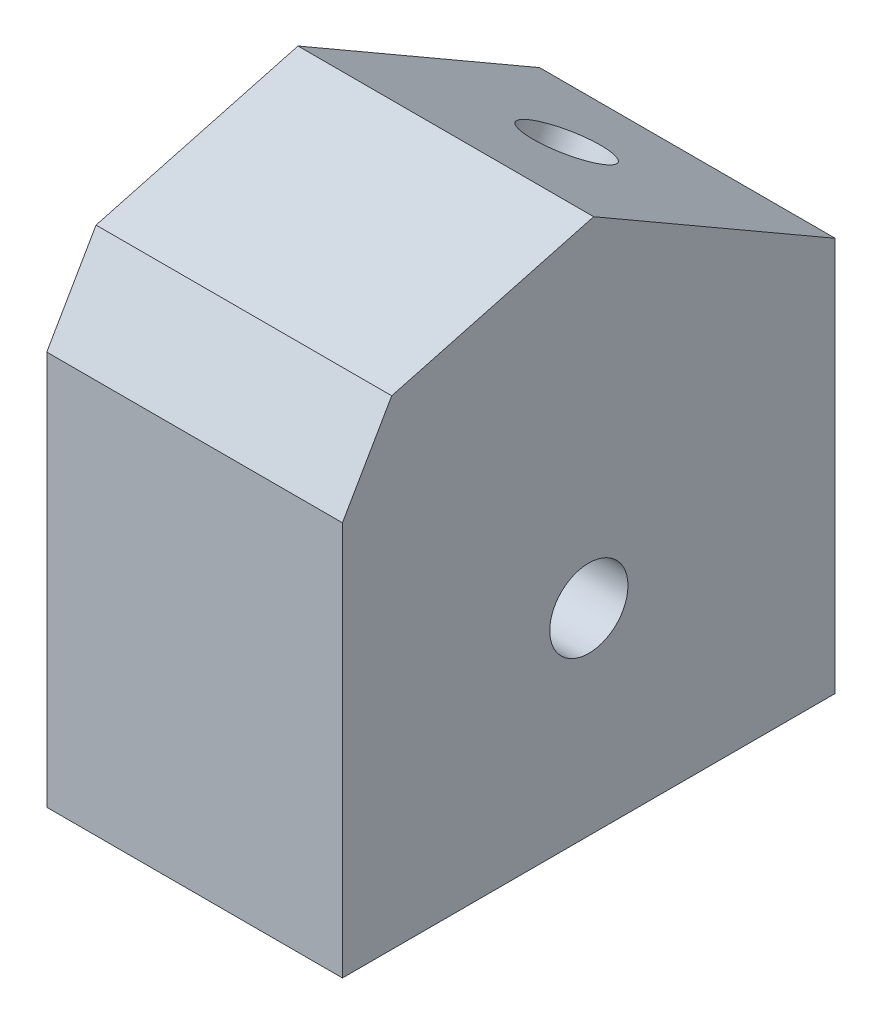
ISO-10303-21;
HEADER;
FILE_DESCRIPTION(('STEP AP214'),'2;1');
FILE_NAME('part.step','',(''),(''),'','','');
FILE_SCHEMA(('AUTOMOTIVE_DESIGN { 1 0 10303 214 1 1 1 1 }'));
ENDSEC;
DATA;
#1=APPLICATION_CONTEXT('core data for automotive mechanical design processes');
#2=APPLICATION_PROTOCOL_DEFINITION('international standard','automotive_design',2000,#1);
#3=PRODUCT_CONTEXT('',#1,'mechanical');
#4=PRODUCT('Part','Part','',(#3));
#5=PRODUCT_RELATED_PRODUCT_CATEGORY('part','',(#4));
#6=PRODUCT_DEFINITION_FORMATION('','',#4);
#7=PRODUCT_DEFINITION_CONTEXT('part definition',#1,'design');
#8=PRODUCT_DEFINITION('design','',#6,#7);
#9=PRODUCT_DEFINITION_SHAPE('','',#8);
#10=(LENGTH_UNIT() NAMED_UNIT(*) SI_UNIT(.MILLI.,.METRE.));
#11=(NAMED_UNIT(*) PLANE_ANGLE_UNIT() SI_UNIT($,.RADIAN.));
#12=(NAMED_UNIT(*) SI_UNIT($,.STERADIAN.) SOLID_ANGLE_UNIT());
#13=UNCERTAINTY_MEASURE_WITH_UNIT(LENGTH_MEASURE(1.E-05),#10,'distance_accuracy_value','');
#14=(GEOMETRIC_REPRESENTATION_CONTEXT(3) GLOBAL_UNCERTAINTY_ASSIGNED_CONTEXT((#13)) GLOBAL_UNIT_ASSIGNED_CONTEXT((#10,
#11,#12)) REPRESENTATION_CONTEXT('',''));
#15=CARTESIAN_POINT('',(0.,0.,0.));
#16=DIRECTION('',(0.,0.,1.));
#17=DIRECTION('',(1.,0.,0.));
#18=AXIS2_PLACEMENT_3D('',#15,#16,#17);
#19=CARTESIAN_POINT('',(15.,0.,0.));
#20=DIRECTION('',(-1.,0.,0.));
#21=DIRECTION('',(0.,0.,1.));
#22=AXIS2_PLACEMENT_3D('',#19,#20,#21);
#23=PLANE('',#22);
#24=DIRECTION('',(0.,0.499999999999994,0.866025403784442));
#25=VECTOR('',#24,1.);
#26=CARTESIAN_POINT('',(15.,41.6506350946108,12.5000000000003));
#27=LINE('',#26,#25);
#28=CARTESIAN_POINT('',(15.,20.,-25.));
#29=VERTEX_POINT('',#28);
#30=CARTESIAN_POINT('',(15.,34.1506350946109,-0.490381056766371));
#31=VERTEX_POINT('',#30);
#32=EDGE_CURVE('E123',#29,#31,#27,.T.);
#33=ORIENTED_EDGE('',*,*,#32,.T.);
#34=DIRECTION('',(0.,0.258819045102526,-0.965925826289067));
#35=VECTOR('',#34,1.);
#36=CARTESIAN_POINT('',(15.,28.6602540378442,20.0000000000002));
#37=LINE('',#36,#35);
#38=CARTESIAN_POINT('',(15.,28.6602540378442,20.0000000000002));
#39=VERTEX_POINT('',#38);
#40=EDGE_CURVE('E11',#31,#39,#37,.F.);
#41=ORIENTED_EDGE('',*,*,#40,.T.);
#42=DIRECTION('',(0.,-0.866025403784442,0.499999999999994));
#43=VECTOR('',#42,1.);
#44=CARTESIAN_POINT('',(15.,20.,25.));
#45=LINE('',#44,#43);
#46=CARTESIAN_POINT('',(15.,20.,25.));
#47=VERTEX_POINT('',#46);
#48=EDGE_CURVE('E126',#39,#47,#45,.T.);
#49=ORIENTED_EDGE('',*,*,#48,.T.);
#50=DIRECTION('',(0.,-1.,0.));
#51=VECTOR('',#50,1.);
#52=CARTESIAN_POINT('',(15.,-20.,25.));
#53=LINE('',#52,#51);
#54=CARTESIAN_POINT('',(15.,-20.,25.));
#55=VERTEX_POINT('',#54);
#56=EDGE_CURVE('E141',#47,#55,#53,.T.);
#57=ORIENTED_EDGE('',*,*,#56,.T.);
#58=DIRECTION('',(0.,0.,-1.));
#59=VECTOR('',#58,1.);
#60=CARTESIAN_POINT('',(15.,-20.,-25.));
#61=LINE('',#60,#59);
#62=CARTESIAN_POINT('',(15.,-20.,-25.));
#63=VERTEX_POINT('',#62);
#64=EDGE_CURVE('E139',#55,#63,#61,.T.);
#65=ORIENTED_EDGE('',*,*,#64,.T.);
#66=DIRECTION('',(0.,1.,0.));
#67=VECTOR('',#66,1.);
#68=CARTESIAN_POINT('',(15.,-20.,-25.));
#69=LINE('',#68,#67);
#70=EDGE_CURVE('E137',#63,#29,#69,.T.);
#71=ORIENTED_EDGE('',*,*,#70,.T.);
#72=EDGE_LOOP('',(#33,#41,#49,#57,#65,#71));
#73=FACE_BOUND('',#72,.T.);
#74=CARTESIAN_POINT('',(15.,0.,0.));
#75=DIRECTION('',(1.,0.,0.));
#76=DIRECTION('',(0.,0.,-1.));
#77=AXIS2_PLACEMENT_3D('',#74,#75,#76);
#78=CIRCLE('',#77,3.97);
#79=CARTESIAN_POINT('',(15.,0.,-3.96999999999999));
#80=VERTEX_POINT('',#79);
#81=EDGE_CURVE('E135',#80,#80,#78,.T.);
#82=ORIENTED_EDGE('',*,*,#81,.F.);
#83=EDGE_LOOP('',(#82));
#84=FACE_BOUND('',#83,.T.);
#85=ADVANCED_FACE('F38',(#73,#84),#23,.F.);
#86=CARTESIAN_POINT('',(-15.,0.,0.));
#87=DIRECTION('',(-1.,0.,0.));
#88=DIRECTION('',(0.,0.,1.));
#89=AXIS2_PLACEMENT_3D('',#86,#87,#88);
#90=PLANE('',#89);
#91=DIRECTION('',(0.,-0.866025403784442,0.499999999999994));
#92=VECTOR('',#91,1.);
#93=CARTESIAN_POINT('',(-15.,20.,25.));
#94=LINE('',#93,#92);
#95=CARTESIAN_POINT('',(-15.,28.6602540378442,20.0000000000002));
#96=VERTEX_POINT('',#95);
#97=CARTESIAN_POINT('',(-15.,20.,25.));
#98=VERTEX_POINT('',#97);
#99=EDGE_CURVE('E133',#96,#98,#94,.T.);
#100=ORIENTED_EDGE('',*,*,#99,.F.);
#101=DIRECTION('',(0.,-0.258819045102526,0.965925826289067));
#102=VECTOR('',#101,1.);
#103=CARTESIAN_POINT('',(-15.,31.7403810567664,8.50480947161685));
#104=LINE('',#103,#102);
#105=CARTESIAN_POINT('',(-15.,34.1506350946109,-0.490381056766371));
#106=VERTEX_POINT('',#105);
#107=EDGE_CURVE('E60',#96,#106,#104,.F.);
#108=ORIENTED_EDGE('',*,*,#107,.T.);
#109=DIRECTION('',(0.,0.499999999999994,0.866025403784442));
#110=VECTOR('',#109,1.);
#111=CARTESIAN_POINT('',(-15.,41.6506350946108,12.5000000000003));
#112=LINE('',#111,#110);
#113=CARTESIAN_POINT('',(-15.,20.,-25.));
#114=VERTEX_POINT('',#113);
#115=EDGE_CURVE('E124',#114,#106,#112,.T.);
#116=ORIENTED_EDGE('',*,*,#115,.F.);
#117=DIRECTION('',(0.,1.,0.));
#118=VECTOR('',#117,1.);
#119=CARTESIAN_POINT('',(-15.,-20.,-25.));
#120=LINE('',#119,#118);
#121=CARTESIAN_POINT('',(-15.,-20.,-25.));
#122=VERTEX_POINT('',#121);
#123=EDGE_CURVE('E127',#122,#114,#120,.T.);
#124=ORIENTED_EDGE('',*,*,#123,.F.);
#125=DIRECTION('',(0.,0.,-1.));
#126=VECTOR('',#125,1.);
#127=CARTESIAN_POINT('',(-15.,-20.,-25.));
#128=LINE('',#127,#126);
#129=CARTESIAN_POINT('',(-15.,-20.,25.));
#130=VERTEX_POINT('',#129);
#131=EDGE_CURVE('E129',#130,#122,#128,.T.);
#132=ORIENTED_EDGE('',*,*,#131,.F.);
#133=DIRECTION('',(0.,-1.,0.));
#134=VECTOR('',#133,1.);
#135=CARTESIAN_POINT('',(-15.,-20.,25.));
#136=LINE('',#135,#134);
#137=EDGE_CURVE('E131',#98,#130,#136,.T.);
#138=ORIENTED_EDGE('',*,*,#137,.F.);
#139=EDGE_LOOP('',(#100,#108,#116,#124,#132,#138));
#140=FACE_BOUND('',#139,.T.);
#141=CARTESIAN_POINT('',(-15.,0.,0.));
#142=DIRECTION('',(1.,0.,0.));
#143=DIRECTION('',(0.,0.,-1.));
#144=AXIS2_PLACEMENT_3D('',#141,#142,#143);
#145=CIRCLE('',#144,3.97);
#146=CARTESIAN_POINT('',(-15.,0.,-3.96999999999999));
#147=VERTEX_POINT('',#146);
#148=EDGE_CURVE('E144',#147,#147,#145,.T.);
#149=ORIENTED_EDGE('',*,*,#148,.T.);
#150=EDGE_LOOP('',(#149));
#151=FACE_BOUND('',#150,.T.);
#152=ADVANCED_FACE('F194',(#140,#151),#90,.T.);
#153=CARTESIAN_POINT('',(15.,20.,25.));
#154=DIRECTION('',(0.,-0.499999999999994,-0.866025403784442));
#155=DIRECTION('',(0.,0.866025403784442,-0.499999999999994));
#156=AXIS2_PLACEMENT_3D('',#153,#154,#155);
#157=PLANE('',#156);
#158=ORIENTED_EDGE('',*,*,#48,.F.);
#159=DIRECTION('',(-1.,0.,0.));
#160=VECTOR('',#159,1.);
#161=CARTESIAN_POINT('',(15.,28.6602540378442,20.0000000000002));
#162=LINE('',#161,#160);
#163=EDGE_CURVE('E106',#39,#96,#162,.T.);
#164=ORIENTED_EDGE('',*,*,#163,.T.);
#165=ORIENTED_EDGE('',*,*,#99,.T.);
#166=DIRECTION('',(-1.,0.,0.));
#167=VECTOR('',#166,1.);
#168=CARTESIAN_POINT('',(15.,20.,25.));
#169=LINE('',#168,#167);
#170=EDGE_CURVE('E102',#47,#98,#169,.T.);
#171=ORIENTED_EDGE('',*,*,#170,.F.);
#172=EDGE_LOOP('',(#158,#164,#165,#171));
#173=FACE_BOUND('',#172,.T.);
#174=ADVANCED_FACE('F182',(#173),#157,.F.);
#175=CARTESIAN_POINT('',(15.,-20.,25.));
#176=DIRECTION('',(0.,0.,-1.));
#177=DIRECTION('',(-1.,0.,0.));
#178=AXIS2_PLACEMENT_3D('',#175,#176,#177);
#179=PLANE('',#178);
#180=ORIENTED_EDGE('',*,*,#137,.T.);
#181=DIRECTION('',(-1.,0.,0.));
#182=VECTOR('',#181,1.);
#183=CARTESIAN_POINT('',(15.,-20.,25.));
#184=LINE('',#183,#182);
#185=EDGE_CURVE('E114',#55,#130,#184,.T.);
#186=ORIENTED_EDGE('',*,*,#185,.F.);
#187=ORIENTED_EDGE('',*,*,#56,.F.);
#188=ORIENTED_EDGE('',*,*,#170,.T.);
#189=EDGE_LOOP('',(#180,#186,#187,#188));
#190=FACE_BOUND('',#189,.T.);
#191=ADVANCED_FACE('F185',(#190),#179,.F.);
#192=CARTESIAN_POINT('',(15.,-20.,-25.));
#193=DIRECTION('',(0.,1.,0.));
#194=DIRECTION('',(0.,0.,1.));
#195=AXIS2_PLACEMENT_3D('',#192,#193,#194);
#196=PLANE('',#195);
#197=ORIENTED_EDGE('',*,*,#131,.T.);
#198=DIRECTION('',(-1.,0.,0.));
#199=VECTOR('',#198,1.);
#200=CARTESIAN_POINT('',(15.,-20.,-25.));
#201=LINE('',#200,#199);
#202=EDGE_CURVE('E117',#63,#122,#201,.T.);
#203=ORIENTED_EDGE('',*,*,#202,.F.);
#204=ORIENTED_EDGE('',*,*,#64,.F.);
#205=ORIENTED_EDGE('',*,*,#185,.T.);
#206=EDGE_LOOP('',(#197,#203,#204,#205));
#207=FACE_BOUND('',#206,.T.);
#208=ADVANCED_FACE('F191',(#207),#196,.F.);
#209=CARTESIAN_POINT('',(15.,-20.,-25.));
#210=DIRECTION('',(0.,0.,1.));
#211=DIRECTION('',(1.,0.,0.));
#212=AXIS2_PLACEMENT_3D('',#209,#210,#211);
#213=PLANE('',#212);
#214=CARTESIAN_POINT('',(0.,0.,-25.));
#215=DIRECTION('',(0.,0.,-1.));
#216=DIRECTION('',(-1.,0.,0.));
#217=AXIS2_PLACEMENT_3D('',#214,#215,#216);
#218=CIRCLE('',#217,3.97);
#219=CARTESIAN_POINT('',(-3.97,0.,-25.));
#220=VERTEX_POINT('',#219);
#221=EDGE_CURVE('E147',#220,#220,#218,.T.);
#222=ORIENTED_EDGE('',*,*,#221,.F.);
#223=EDGE_LOOP('',(#222));
#224=FACE_BOUND('',#223,.T.);
#225=ORIENTED_EDGE('',*,*,#123,.T.);
#226=DIRECTION('',(-1.,0.,0.));
#227=VECTOR('',#226,1.);
#228=CARTESIAN_POINT('',(15.,20.,-25.));
#229=LINE('',#228,#227);
#230=EDGE_CURVE('E120',#29,#114,#229,.T.);
#231=ORIENTED_EDGE('',*,*,#230,.F.);
#232=ORIENTED_EDGE('',*,*,#70,.F.);
#233=ORIENTED_EDGE('',*,*,#202,.T.);
#234=EDGE_LOOP('',(#225,#231,#232,#233));
#235=FACE_BOUND('',#234,.T.);
#236=ADVANCED_FACE('F169',(#224,#235),#213,.F.);
#237=CARTESIAN_POINT('',(15.,41.6506350946108,12.5000000000003));
#238=DIRECTION('',(0.,-0.866025403784442,0.499999999999994));
#239=DIRECTION('',(0.,-0.499999999999994,-0.866025403784442));
#240=AXIS2_PLACEMENT_3D('',#237,#238,#239);
#241=PLANE('',#240);
#242=CARTESIAN_POINT('',(0.,27.0753175473054,-12.7451905283832));
#243=DIRECTION('',(0.,0.866025403784442,-0.499999999999994));
#244=DIRECTION('',(0.,0.499999999999994,0.866025403784442));
#245=AXIS2_PLACEMENT_3D('',#242,#243,#244);
#246=CIRCLE('',#245,3.97);
#247=CARTESIAN_POINT('',(0.,29.0603175473054,-9.30706967535894));
#248=VERTEX_POINT('',#247);
#249=EDGE_CURVE('E153',#248,#248,#246,.T.);
#250=ORIENTED_EDGE('',*,*,#249,.F.);
#251=EDGE_LOOP('',(#250));
#252=FACE_BOUND('',#251,.T.);
#253=ORIENTED_EDGE('',*,*,#115,.T.);
#254=DIRECTION('',(1.,0.,0.));
#255=VECTOR('',#254,1.);
#256=CARTESIAN_POINT('',(15.,34.1506350946109,-0.490381056766373));
#257=LINE('',#256,#255);
#258=EDGE_CURVE('E46',#106,#31,#257,.T.);
#259=ORIENTED_EDGE('',*,*,#258,.T.);
#260=ORIENTED_EDGE('',*,*,#32,.F.);
#261=ORIENTED_EDGE('',*,*,#230,.T.);
#262=EDGE_LOOP('',(#253,#259,#260,#261));
#263=FACE_BOUND('',#262,.T.);
#264=ADVANCED_FACE('F167',(#252,#263),#241,.F.);
#265=CARTESIAN_POINT('',(15.,0.,0.));
#266=DIRECTION('',(-1.,0.,0.));
#267=DIRECTION('',(0.,0.,1.));
#268=AXIS2_PLACEMENT_3D('',#265,#266,#267);
#269=CYLINDRICAL_SURFACE('',#268,3.97);
#270=CARTESIAN_POINT('',(0.,0.,0.));
#271=DIRECTION('',(-0.707106781186547,0.,-0.707106781186547));
#272=DIRECTION('',(-0.707106781186547,0.,0.707106781186547));
#273=AXIS2_PLACEMENT_3D('',#270,#271,#272);
#274=ELLIPSE('',#273,5.61442784262119,3.97);
#275=CARTESIAN_POINT('',(0.,-3.97000000000001,0.));
#276=VERTEX_POINT('',#275);
#277=CARTESIAN_POINT('',(0.,3.96999999999999,0.));
#278=VERTEX_POINT('',#277);
#279=EDGE_CURVE('E100',#276,#278,#274,.F.);
#280=ORIENTED_EDGE('',*,*,#279,.F.);
#281=CARTESIAN_POINT('',(0.,0.,0.));
#282=DIRECTION('',(-0.707106781186547,0.,0.707106781186547));
#283=DIRECTION('',(-0.707106781186547,0.,-0.707106781186547));
#284=AXIS2_PLACEMENT_3D('',#281,#282,#283);
#285=ELLIPSE('',#284,5.61442784262119,3.97);
#286=EDGE_CURVE('E96',#278,#276,#285,.T.);
#287=ORIENTED_EDGE('',*,*,#286,.F.);
#288=EDGE_LOOP('',(#280,#287));
#289=FACE_BOUND('',#288,.T.);
#290=ORIENTED_EDGE('',*,*,#81,.T.);
#291=EDGE_LOOP('',(#290));
#292=FACE_BOUND('',#291,.T.);
#293=ORIENTED_EDGE('',*,*,#148,.F.);
#294=EDGE_LOOP('',(#293));
#295=FACE_BOUND('',#294,.T.);
#296=ADVANCED_FACE('F104',(#289,#292,#295),#269,.F.);
#297=CARTESIAN_POINT('',(0.,0.,0.));
#298=DIRECTION('',(0.,0.,-1.));
#299=DIRECTION('',(-1.,0.,0.));
#300=AXIS2_PLACEMENT_3D('',#297,#298,#299);
#301=CYLINDRICAL_SURFACE('',#300,3.97);
#302=ORIENTED_EDGE('',*,*,#279,.T.);
#303=ORIENTED_EDGE('',*,*,#286,.T.);
#304=EDGE_LOOP('',(#302,#303));
#305=FACE_BOUND('',#304,.T.);
#306=ORIENTED_EDGE('',*,*,#221,.T.);
#307=EDGE_LOOP('',(#306));
#308=FACE_BOUND('',#307,.T.);
#309=ADVANCED_FACE('F98',(#305,#308),#301,.F.);
#310=CARTESIAN_POINT('',(15.,28.6602540378442,20.0000000000002));
#311=DIRECTION('',(0.,-0.965925826289067,-0.258819045102526));
#312=DIRECTION('',(-1.,0.,0.));
#313=AXIS2_PLACEMENT_3D('',#310,#311,#312);
#314=PLANE('',#313);
#315=ORIENTED_EDGE('',*,*,#40,.F.);
#316=ORIENTED_EDGE('',*,*,#258,.F.);
#317=ORIENTED_EDGE('',*,*,#107,.F.);
#318=ORIENTED_EDGE('',*,*,#163,.F.);
#319=EDGE_LOOP('',(#315,#316,#317,#318));
#320=FACE_BOUND('',#319,.T.);
#321=ADVANCED_FACE('F40',(#320),#314,.F.);
#322=CARTESIAN_POINT('',(0.,14.0849364905388,-5.24519052838326));
#323=DIRECTION('',(0.,0.866025403784442,-0.499999999999994));
#324=DIRECTION('',(0.,0.499999999999994,0.866025403784442));
#325=AXIS2_PLACEMENT_3D('',#322,#323,#324);
#326=CYLINDRICAL_SURFACE('',#325,3.97);
#327=CARTESIAN_POINT('',(0.,14.0849364905388,-5.24519052838326));
#328=DIRECTION('',(0.,0.866025403784442,-0.499999999999994));
#329=DIRECTION('',(0.,0.499999999999994,0.866025403784442));
#330=AXIS2_PLACEMENT_3D('',#327,#328,#329);
#331=CIRCLE('',#330,3.97);
#332=CARTESIAN_POINT('',(0.,16.0699364905388,-1.80706967535903));
#333=VERTEX_POINT('',#332);
#334=EDGE_CURVE('E152',#333,#333,#331,.T.);
#335=ORIENTED_EDGE('',*,*,#334,.F.);
#336=EDGE_LOOP('',(#335));
#337=FACE_BOUND('',#336,.T.);
#338=ORIENTED_EDGE('',*,*,#249,.T.);
#339=EDGE_LOOP('',(#338));
#340=FACE_BOUND('',#339,.T.);
#341=ADVANCED_FACE('F161',(#337,#340),#326,.F.);
#342=CARTESIAN_POINT('',(0.,14.0849364905388,-5.24519052838326));
#343=DIRECTION('',(0.,0.866025403784442,-0.499999999999994));
#344=DIRECTION('',(0.,0.499999999999994,0.866025403784442));
#345=AXIS2_PLACEMENT_3D('',#342,#343,#344);
#346=PLANE('',#345);
#347=ORIENTED_EDGE('',*,*,#334,.T.);
#348=EDGE_LOOP('',(#347));
#349=FACE_BOUND('',#348,.T.);
#350=ADVANCED_FACE('F159',(#349),#346,.T.);
#351=CLOSED_SHELL('',(#85,#152,#174,#191,#208,#236,#264,#296,#309,#321,#341,#350));
#352=MANIFOLD_SOLID_BREP('B2',#351);
#353=ADVANCED_BREP_SHAPE_REPRESENTATION('',(#18,#352),#14);
#354=SHAPE_DEFINITION_REPRESENTATION(#9,#353);
ENDSEC;
END-ISO-10303-21;
